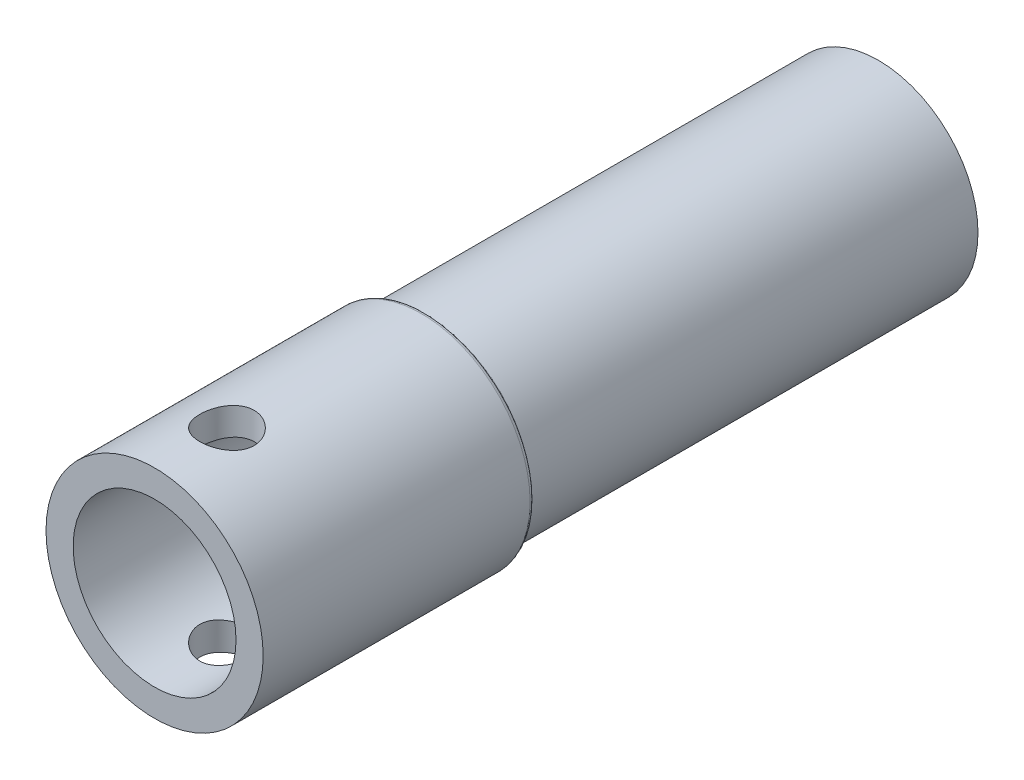
ISO-10303-21;
HEADER;
FILE_DESCRIPTION(('STEP AP214'),'2;1');
FILE_NAME('part.step','',(''),(''),'','','');
FILE_SCHEMA(('AUTOMOTIVE_DESIGN { 1 0 10303 214 1 1 1 1 }'));
ENDSEC;
DATA;
#1=APPLICATION_CONTEXT('core data for automotive mechanical design processes');
#2=APPLICATION_PROTOCOL_DEFINITION('international standard','automotive_design',2000,#1);
#3=PRODUCT_CONTEXT('',#1,'mechanical');
#4=PRODUCT('Part','Part','',(#3));
#5=PRODUCT_RELATED_PRODUCT_CATEGORY('part','',(#4));
#6=PRODUCT_DEFINITION_FORMATION('','',#4);
#7=PRODUCT_DEFINITION_CONTEXT('part definition',#1,'design');
#8=PRODUCT_DEFINITION('design','',#6,#7);
#9=PRODUCT_DEFINITION_SHAPE('','',#8);
#10=(LENGTH_UNIT() NAMED_UNIT(*) SI_UNIT(.MILLI.,.METRE.));
#11=(NAMED_UNIT(*) PLANE_ANGLE_UNIT() SI_UNIT($,.RADIAN.));
#12=(NAMED_UNIT(*) SI_UNIT($,.STERADIAN.) SOLID_ANGLE_UNIT());
#13=UNCERTAINTY_MEASURE_WITH_UNIT(LENGTH_MEASURE(1.E-05),#10,'distance_accuracy_value','');
#14=(GEOMETRIC_REPRESENTATION_CONTEXT(3) GLOBAL_UNCERTAINTY_ASSIGNED_CONTEXT((#13)) GLOBAL_UNIT_ASSIGNED_CONTEXT((#10,
#11,#12)) REPRESENTATION_CONTEXT('',''));
#15=CARTESIAN_POINT('',(0.,0.,0.));
#16=DIRECTION('',(0.,0.,1.));
#17=DIRECTION('',(1.,0.,0.));
#18=AXIS2_PLACEMENT_3D('',#15,#16,#17);
#19=CARTESIAN_POINT('',(0.,0.,30.));
#20=DIRECTION('',(0.,0.,1.));
#21=DIRECTION('',(1.,0.,0.));
#22=AXIS2_PLACEMENT_3D('',#19,#20,#21);
#23=PLANE('',#22);
#24=CARTESIAN_POINT('',(0.,0.,30.));
#25=DIRECTION('',(0.,0.,1.));
#26=DIRECTION('',(1.,0.,0.));
#27=AXIS2_PLACEMENT_3D('',#24,#25,#26);
#28=CIRCLE('',#27,12.);
#29=CARTESIAN_POINT('',(12.,0.,30.));
#30=VERTEX_POINT('',#29);
#31=EDGE_CURVE('E53',#30,#30,#28,.T.);
#32=ORIENTED_EDGE('',*,*,#31,.T.);
#33=EDGE_LOOP('',(#32));
#34=FACE_BOUND('',#33,.T.);
#35=CARTESIAN_POINT('',(0.,0.,30.));
#36=DIRECTION('',(0.,0.,1.));
#37=DIRECTION('',(1.,0.,0.));
#38=AXIS2_PLACEMENT_3D('',#35,#36,#37);
#39=CIRCLE('',#38,9.);
#40=CARTESIAN_POINT('',(9.,0.,30.));
#41=VERTEX_POINT('',#40);
#42=EDGE_CURVE('E122',#41,#41,#39,.T.);
#43=ORIENTED_EDGE('',*,*,#42,.F.);
#44=EDGE_LOOP('',(#43));
#45=FACE_BOUND('',#44,.T.);
#46=ADVANCED_FACE('F39',(#34,#45),#23,.T.);
#47=CARTESIAN_POINT('',(0.,0.,30.));
#48=DIRECTION('',(0.,0.,-1.));
#49=DIRECTION('',(-1.,0.,0.));
#50=AXIS2_PLACEMENT_3D('',#47,#48,#49);
#51=CYLINDRICAL_SURFACE('',#50,12.);
#52=CARTESIAN_POINT('',(0.,0.,0.5));
#53=DIRECTION('',(0.,0.,1.));
#54=DIRECTION('',(1.,0.,0.));
#55=AXIS2_PLACEMENT_3D('',#52,#53,#54);
#56=CIRCLE('',#55,12.);
#57=CARTESIAN_POINT('',(12.,0.,0.5));
#58=VERTEX_POINT('',#57);
#59=EDGE_CURVE('E48',#58,#58,#56,.T.);
#60=ORIENTED_EDGE('',*,*,#59,.T.);
#61=EDGE_LOOP('',(#60));
#62=FACE_BOUND('',#61,.T.);
#63=CARTESIAN_POINT('',(0.,-12.,25.));
#64=CARTESIAN_POINT('',(0.165752177339462,-11.9999971973602,24.9999953485237));
#65=CARTESIAN_POINT('',(0.331556315661526,-11.9965315626365,24.9862168984524));
#66=CARTESIAN_POINT('',(0.658412647541065,-11.9830422765979,24.931549697386));
#67=CARTESIAN_POINT('',(0.819462093741479,-11.9730149083995,24.8906455809243));
#68=CARTESIAN_POINT('',(1.13204174436515,-11.9475125266406,24.7831214930758));
#69=CARTESIAN_POINT('',(1.28358312686,-11.9320440568412,24.7165324025695));
#70=CARTESIAN_POINT('',(1.57334426380885,-11.8973068761524,24.5596372199103));
#71=CARTESIAN_POINT('',(1.71156356869753,-11.8780380370831,24.4693303277621));
#72=CARTESIAN_POINT('',(1.97360385460183,-11.8373482718339,24.2655984206916));
#73=CARTESIAN_POINT('',(2.09711138012211,-11.8158941429625,24.1517768500819));
#74=CARTESIAN_POINT('',(2.32349785440664,-11.7734724023587,23.9050955901819));
#75=CARTESIAN_POINT('',(2.42637447389838,-11.7525048457974,23.7722337541061));
#76=CARTESIAN_POINT('',(2.61005308559795,-11.7130955139634,23.488809546526));
#77=CARTESIAN_POINT('',(2.69050443185028,-11.6946958892962,23.3380135383825));
#78=CARTESIAN_POINT('',(2.82479381710149,-11.6629898963603,23.0245031766799));
#79=CARTESIAN_POINT('',(2.87863611088028,-11.6496827138884,22.861790733336));
#80=CARTESIAN_POINT('',(2.95710967360953,-11.6300095339265,22.5325130035967));
#81=CARTESIAN_POINT('',(2.98230453666411,-11.6235098199402,22.366090207924));
#82=CARTESIAN_POINT('',(3.00452355013282,-11.6177872491918,22.0312628620013));
#83=CARTESIAN_POINT('',(3.00155228363622,-11.6185632085586,21.8628586386157));
#84=CARTESIAN_POINT('',(2.96797304927941,-11.6271841103363,21.5331683845093));
#85=CARTESIAN_POINT('',(2.93803668038127,-11.6348572601459,21.3718087570693));
#86=CARTESIAN_POINT('',(2.85244837380599,-11.6561341934214,21.0564778981779));
#87=CARTESIAN_POINT('',(2.79679460413879,-11.6697383993848,20.9025071939422));
#88=CARTESIAN_POINT('',(2.66077895587437,-11.7015022781132,20.6045239674957));
#89=CARTESIAN_POINT('',(2.58017333446584,-11.7197065493963,20.4606276564209));
#90=CARTESIAN_POINT('',(2.39671255202989,-11.7585942169198,20.1881625804864));
#91=CARTESIAN_POINT('',(2.29385349761767,-11.7792780466926,20.0595965038655));
#92=CARTESIAN_POINT('',(2.06532684936244,-11.8215176107978,19.8175927686112));
#93=CARTESIAN_POINT('',(1.93909251633172,-11.84308138956,19.7046910198773));
#94=CARTESIAN_POINT('',(1.6692238350074,-11.8841193115751,19.5015575150722));
#95=CARTESIAN_POINT('',(1.52558895541589,-11.9035933909882,19.4113264514729));
#96=CARTESIAN_POINT('',(1.22423177736278,-11.9383546418838,19.2558988275512));
#97=CARTESIAN_POINT('',(1.06646278641725,-11.9536272025545,19.1907893194911));
#98=CARTESIAN_POINT('',(0.741752016285768,-11.9781583398283,19.0881653885809));
#99=CARTESIAN_POINT('',(0.574811998300971,-11.9874180667856,19.0506456871637));
#100=CARTESIAN_POINT('',(0.241079940780054,-11.9987099854275,19.0050848688823));
#101=CARTESIAN_POINT('',(0.0743934399764207,-12.0009210701655,18.9963139478494));
#102=CARTESIAN_POINT('',(-0.258065749603016,-11.998376096289,19.006498004111));
#103=CARTESIAN_POINT('',(-0.423838519289191,-11.9936206648371,19.0254504855983));
#104=CARTESIAN_POINT('',(-0.747228537552979,-11.977791622547,19.0899418167827));
#105=CARTESIAN_POINT('',(-0.904930237937498,-11.9668126837158,19.1350825269539));
#106=CARTESIAN_POINT('',(-1.21051458490503,-11.9397741326831,19.2502141680569));
#107=CARTESIAN_POINT('',(-1.3583962380653,-11.9237140073996,19.3202076086264));
#108=CARTESIAN_POINT('',(-1.64304626885966,-11.8878661585244,19.4844722577493));
#109=CARTESIAN_POINT('',(-1.77957088367153,-11.868017347332,19.5791522247931));
#110=CARTESIAN_POINT('',(-2.03505322728662,-11.826890183755,19.7895798175943));
#111=CARTESIAN_POINT('',(-2.15400791794649,-11.8056115850589,19.9053310792353));
#112=CARTESIAN_POINT('',(-2.37398113614497,-11.76337913919,20.1580039216874));
#113=CARTESIAN_POINT('',(-2.4744877352422,-11.7424460836496,20.2953754059991));
#114=CARTESIAN_POINT('',(-2.65102151802725,-11.7038575676408,20.5854652689372));
#115=CARTESIAN_POINT('',(-2.72704978832281,-11.6862019616993,20.7381829659409));
#116=CARTESIAN_POINT('',(-2.85190284121468,-11.656361894336,21.0538114448125));
#117=CARTESIAN_POINT('',(-2.90088879328717,-11.6441451045097,21.2166552566246));
#118=CARTESIAN_POINT('',(-2.97069131988587,-11.626534880479,21.5486192757106));
#119=CARTESIAN_POINT('',(-2.99151405495182,-11.6211399540485,21.7177381020429));
#120=CARTESIAN_POINT('',(-3.004077180673,-11.6178980244194,22.0522420477232));
#121=CARTESIAN_POINT('',(-2.99663579556158,-11.6198386546564,22.2175948702529));
#122=CARTESIAN_POINT('',(-2.95475455662439,-11.6305581800657,22.5446077773325));
#123=CARTESIAN_POINT('',(-2.92031524537318,-11.6393369378128,22.7062679360264));
#124=CARTESIAN_POINT('',(-2.82586263888595,-11.6626252136787,23.0204169181317));
#125=CARTESIAN_POINT('',(-2.76600280936085,-11.6771003047327,23.1729546104807));
#126=CARTESIAN_POINT('',(-2.62252982721005,-11.7101551144901,23.4659307654271));
#127=CARTESIAN_POINT('',(-2.53891338006835,-11.7287354024137,23.6063675463738));
#128=CARTESIAN_POINT('',(-2.3477354972743,-11.7685126852721,23.8751092580041));
#129=CARTESIAN_POINT('',(-2.23960632582452,-11.7897652966356,24.0030021468479));
#130=CARTESIAN_POINT('',(-2.00357874237946,-11.8321605449252,24.2390940895908));
#131=CARTESIAN_POINT('',(-1.87567564252229,-11.8533031545411,24.3472884602259));
#132=CARTESIAN_POINT('',(-1.60093517340518,-11.8935531129534,24.5428226171292));
#133=CARTESIAN_POINT('',(-1.45379684463277,-11.9126166673174,24.6297492273432));
#134=CARTESIAN_POINT('',(-1.14653211902095,-11.9460984995023,24.7774949258811));
#135=CARTESIAN_POINT('',(-0.986415126873481,-11.9605201039956,24.8383327212971));
#136=CARTESIAN_POINT('',(-0.688820506486946,-11.9809611913108,24.9231436606593));
#137=CARTESIAN_POINT('',(-0.55276034181614,-11.9880517010538,24.9519024861069));
#138=CARTESIAN_POINT('',(-0.277812143072569,-11.997572104639,24.9903318872439));
#139=CARTESIAN_POINT('',(-0.138924322485234,-12.0000023490179,25.0000038986106));
#140=CARTESIAN_POINT('',(0.,-12.,25.));
#141=B_SPLINE_CURVE_WITH_KNOTS('',3,(#63,#64,#65,#66,#67,#68,#69,#70,#71,#72,#73,#74,#75,#76,
#77,#78,#79,#80,#81,#82,#83,#84,#85,#86,#87,#88,#89,#90,#91,#92,#93,#94,#95,#96,#97,#98,#99,
#100,#101,#102,#103,#104,#105,#106,#107,#108,#109,#110,#111,#112,#113,#114,#115,#116,#117,#118,
#119,#120,#121,#122,#123,#124,#125,#126,#127,#128,#129,#130,#131,#132,#133,#134,#135,#136,#137,
#138,#139,#140),.UNSPECIFIED.,.T.,.F.,(4,2,2,2,2,2,2,2,2,2,2,2,2,2,2,2,2,2,2,2,2,2,2,2,2,2,2,2,
2,2,2,2,2,2,2,2,2,2,4),(0.,0.496747424943779,0.993776475527798,1.49020980457221,
1.98665988033865,2.49228870874278,2.99797459160124,3.51117295091614,4.02428922338737,
4.52712590202139,5.02988076232035,5.52044994020677,6.01105406938718,6.506610557544,
7.00225381678967,7.5120300194468,8.02182179123135,8.53336458024869,9.04480947383927,
9.54316617905194,10.0414780223213,10.5324054903472,11.0233825465122,11.5230717513735,
12.0228472602268,12.5348901841559,13.0469103750566,13.5558450923716,14.0646684651657,
14.5588756080898,15.0530728192382,15.5443280113065,16.0356513628556,16.5397915283158,
17.0440513955259,17.5574437101093,18.0704672765446,18.4868448589605,18.9031911209784),.UNSPECIFIED.);
#142=CARTESIAN_POINT('',(0.,-12.,25.));
#143=VERTEX_POINT('',#142);
#144=EDGE_CURVE('E94',#143,#143,#141,.T.);
#145=ORIENTED_EDGE('',*,*,#144,.T.);
#146=EDGE_LOOP('',(#145));
#147=FACE_BOUND('',#146,.T.);
#148=CARTESIAN_POINT('',(0.,12.,25.));
#149=CARTESIAN_POINT('',(-0.165752177339462,11.9999971973602,24.9999953485237));
#150=CARTESIAN_POINT('',(-0.331556315661527,11.9965315626365,24.9862168984524));
#151=CARTESIAN_POINT('',(-0.658412647541066,11.9830422765979,24.931549697386));
#152=CARTESIAN_POINT('',(-0.819462093741479,11.9730149083995,24.8906455809243));
#153=CARTESIAN_POINT('',(-1.13204174436515,11.9475125266406,24.7831214930758));
#154=CARTESIAN_POINT('',(-1.28358312686,11.9320440568412,24.7165324025695));
#155=CARTESIAN_POINT('',(-1.57334426380885,11.8973068761524,24.5596372199103));
#156=CARTESIAN_POINT('',(-1.71156356869753,11.8780380370831,24.4693303277621));
#157=CARTESIAN_POINT('',(-1.97360385460183,11.8373482718339,24.2655984206916));
#158=CARTESIAN_POINT('',(-2.09711138012211,11.8158941429625,24.1517768500819));
#159=CARTESIAN_POINT('',(-2.32349785440664,11.7734724023587,23.9050955901819));
#160=CARTESIAN_POINT('',(-2.42637447389838,11.7525048457974,23.7722337541061));
#161=CARTESIAN_POINT('',(-2.61005308559795,11.7130955139634,23.488809546526));
#162=CARTESIAN_POINT('',(-2.69050443185028,11.6946958892962,23.3380135383825));
#163=CARTESIAN_POINT('',(-2.82479381710149,11.6629898963603,23.0245031766799));
#164=CARTESIAN_POINT('',(-2.87863611088028,11.6496827138884,22.861790733336));
#165=CARTESIAN_POINT('',(-2.95710967360953,11.6300095339265,22.5325130035967));
#166=CARTESIAN_POINT('',(-2.98230453666411,11.6235098199402,22.366090207924));
#167=CARTESIAN_POINT('',(-3.00452355013282,11.6177872491918,22.0312628620013));
#168=CARTESIAN_POINT('',(-3.00155228363622,11.6185632085586,21.8628586386157));
#169=CARTESIAN_POINT('',(-2.96797304927941,11.6271841103363,21.5331683845093));
#170=CARTESIAN_POINT('',(-2.93803668038127,11.6348572601459,21.3718087570693));
#171=CARTESIAN_POINT('',(-2.85244837380599,11.6561341934214,21.0564778981779));
#172=CARTESIAN_POINT('',(-2.79679460413879,11.6697383993848,20.9025071939422));
#173=CARTESIAN_POINT('',(-2.66077895587437,11.7015022781132,20.6045239674957));
#174=CARTESIAN_POINT('',(-2.58017333446584,11.7197065493963,20.4606276564209));
#175=CARTESIAN_POINT('',(-2.39671255202989,11.7585942169198,20.1881625804864));
#176=CARTESIAN_POINT('',(-2.29385349761767,11.7792780466926,20.0595965038655));
#177=CARTESIAN_POINT('',(-2.06532684936244,11.8215176107978,19.8175927686112));
#178=CARTESIAN_POINT('',(-1.93909251633172,11.84308138956,19.7046910198773));
#179=CARTESIAN_POINT('',(-1.6692238350074,11.8841193115751,19.5015575150722));
#180=CARTESIAN_POINT('',(-1.52558895541589,11.9035933909881,19.4113264514729));
#181=CARTESIAN_POINT('',(-1.22423177736279,11.9383546418838,19.2558988275512));
#182=CARTESIAN_POINT('',(-1.06646278641725,11.9536272025545,19.1907893194911));
#183=CARTESIAN_POINT('',(-0.741752016285768,11.9781583398283,19.0881653885809));
#184=CARTESIAN_POINT('',(-0.574811998300971,11.9874180667856,19.0506456871637));
#185=CARTESIAN_POINT('',(-0.241079940780054,11.9987099854275,19.0050848688823));
#186=CARTESIAN_POINT('',(-0.0743934399764209,12.0009210701655,18.9963139478494));
#187=CARTESIAN_POINT('',(0.258065749603016,11.998376096289,19.006498004111));
#188=CARTESIAN_POINT('',(0.423838519289192,11.9936206648371,19.0254504855983));
#189=CARTESIAN_POINT('',(0.747228537552981,11.977791622547,19.0899418167827));
#190=CARTESIAN_POINT('',(0.904930237937499,11.9668126837158,19.1350825269539));
#191=CARTESIAN_POINT('',(1.21051458490503,11.9397741326831,19.2502141680569));
#192=CARTESIAN_POINT('',(1.3583962380653,11.9237140073996,19.3202076086264));
#193=CARTESIAN_POINT('',(1.64304626885966,11.8878661585244,19.4844722577493));
#194=CARTESIAN_POINT('',(1.77957088367153,11.868017347332,19.5791522247931));
#195=CARTESIAN_POINT('',(2.03505322728662,11.826890183755,19.7895798175943));
#196=CARTESIAN_POINT('',(2.1540079179465,11.8056115850589,19.9053310792353));
#197=CARTESIAN_POINT('',(2.37398113614497,11.76337913919,20.1580039216874));
#198=CARTESIAN_POINT('',(2.47448773524221,11.7424460836496,20.2953754059991));
#199=CARTESIAN_POINT('',(2.65102151802725,11.7038575676408,20.5854652689372));
#200=CARTESIAN_POINT('',(2.72704978832281,11.6862019616993,20.7381829659409));
#201=CARTESIAN_POINT('',(2.85190284121468,11.656361894336,21.0538114448125));
#202=CARTESIAN_POINT('',(2.90088879328717,11.6441451045097,21.2166552566246));
#203=CARTESIAN_POINT('',(2.97069131988587,11.626534880479,21.5486192757106));
#204=CARTESIAN_POINT('',(2.99151405495183,11.6211399540485,21.7177381020429));
#205=CARTESIAN_POINT('',(3.004077180673,11.6178980244194,22.0522420477232));
#206=CARTESIAN_POINT('',(2.99663579556158,11.6198386546564,22.2175948702529));
#207=CARTESIAN_POINT('',(2.95475455662439,11.6305581800657,22.5446077773325));
#208=CARTESIAN_POINT('',(2.92031524537318,11.6393369378128,22.7062679360264));
#209=CARTESIAN_POINT('',(2.82586263888594,11.6626252136787,23.0204169181317));
#210=CARTESIAN_POINT('',(2.76600280936085,11.6771003047327,23.1729546104807));
#211=CARTESIAN_POINT('',(2.62252982721005,11.7101551144901,23.4659307654271));
#212=CARTESIAN_POINT('',(2.53891338006835,11.7287354024137,23.6063675463738));
#213=CARTESIAN_POINT('',(2.3477354972743,11.7685126852721,23.8751092580041));
#214=CARTESIAN_POINT('',(2.23960632582452,11.7897652966356,24.0030021468479));
#215=CARTESIAN_POINT('',(2.00357874237946,11.8321605449252,24.2390940895908));
#216=CARTESIAN_POINT('',(1.87567564252229,11.8533031545411,24.3472884602259));
#217=CARTESIAN_POINT('',(1.60093517340518,11.8935531129534,24.5428226171292));
#218=CARTESIAN_POINT('',(1.45379684463277,11.9126166673174,24.6297492273432));
#219=CARTESIAN_POINT('',(1.14653211902095,11.9460984995023,24.7774949258811));
#220=CARTESIAN_POINT('',(0.98641512687348,11.9605201039956,24.8383327212971));
#221=CARTESIAN_POINT('',(0.688820506486945,11.9809611913108,24.9231436606593));
#222=CARTESIAN_POINT('',(0.552760341816138,11.9880517010538,24.9519024861069));
#223=CARTESIAN_POINT('',(0.277812143072567,11.997572104639,24.9903318872439));
#224=CARTESIAN_POINT('',(0.138924322485233,12.0000023490179,25.0000038986106));
#225=CARTESIAN_POINT('',(0.,12.,25.));
#226=B_SPLINE_CURVE_WITH_KNOTS('',3,(#148,#149,#150,#151,#152,#153,#154,#155,#156,#157,#158,
#159,#160,#161,#162,#163,#164,#165,#166,#167,#168,#169,#170,#171,#172,#173,#174,#175,#176,#177,
#178,#179,#180,#181,#182,#183,#184,#185,#186,#187,#188,#189,#190,#191,#192,#193,#194,#195,#196,
#197,#198,#199,#200,#201,#202,#203,#204,#205,#206,#207,#208,#209,#210,#211,#212,#213,#214,#215,
#216,#217,#218,#219,#220,#221,#222,#223,#224,#225),.UNSPECIFIED.,.T.,.F.,(4,2,2,2,2,2,2,2,2,2,2,
2,2,2,2,2,2,2,2,2,2,2,2,2,2,2,2,2,2,2,2,2,2,2,2,2,2,2,4),(0.,0.49674742494378,0.993776475527799,
1.49020980457221,1.98665988033865,2.49228870874278,2.99797459160124,3.51117295091614,
4.02428922338737,4.5271259020214,5.02988076232035,5.52044994020677,6.01105406938718,
6.506610557544,7.00225381678967,7.5120300194468,8.02182179123135,8.53336458024869,
9.04480947383927,9.54316617905193,10.0414780223213,10.5324054903472,11.0233825465122,
11.5230717513734,12.0228472602268,12.5348901841559,13.0469103750566,13.5558450923716,
14.0646684651657,14.5588756080898,15.0530728192382,15.5443280113065,16.0356513628556,
16.5397915283158,17.0440513955259,17.5574437101093,18.0704672765446,18.4868448589605,
18.9031911209784),.UNSPECIFIED.);
#227=CARTESIAN_POINT('',(0.,12.,25.));
#228=VERTEX_POINT('',#227);
#229=EDGE_CURVE('E65',#228,#228,#226,.T.);
#230=ORIENTED_EDGE('',*,*,#229,.T.);
#231=EDGE_LOOP('',(#230));
#232=FACE_BOUND('',#231,.T.);
#233=ORIENTED_EDGE('',*,*,#31,.F.);
#234=EDGE_LOOP('',(#233));
#235=FACE_BOUND('',#234,.T.);
#236=ADVANCED_FACE('F99',(#62,#147,#232,#235),#51,.T.);
#237=CARTESIAN_POINT('',(0.,0.,30.));
#238=DIRECTION('',(0.,0.,-1.));
#239=DIRECTION('',(-1.,0.,0.));
#240=AXIS2_PLACEMENT_3D('',#237,#238,#239);
#241=CYLINDRICAL_SURFACE('',#240,9.);
#242=CARTESIAN_POINT('',(0.,-9.,25.));
#243=CARTESIAN_POINT('',(0.16369008866017,-9.00000045902832,25.0000007611949));
#244=CARTESIAN_POINT('',(0.327375583615649,-8.99549308522634,24.9865592016183));
#245=CARTESIAN_POINT('',(0.649925282618916,-8.97795630609842,24.9333126735483));
#246=CARTESIAN_POINT('',(0.808788984356453,-8.96492601606458,24.8935049681532));
#247=CARTESIAN_POINT('',(1.11699836850533,-8.93175923719328,24.7890422698479));
#248=CARTESIAN_POINT('',(1.2663594776581,-8.9116346319256,24.7244288126222));
#249=CARTESIAN_POINT('',(1.55212481041597,-8.86633337152025,24.572376481485));
#250=CARTESIAN_POINT('',(1.68852647087612,-8.84115572003334,24.4849331049922));
#251=CARTESIAN_POINT('',(1.9492250250668,-8.78742283329015,24.2865225854237));
#252=CARTESIAN_POINT('',(2.07301110089493,-8.75878669391354,24.1749062972185));
#253=CARTESIAN_POINT('',(2.30049807810625,-8.70180944349364,23.9326985358803));
#254=CARTESIAN_POINT('',(2.40419455646839,-8.67346839871647,23.8021028952145));
#255=CARTESIAN_POINT('',(2.59147482668358,-8.61939997431821,23.5210446544106));
#256=CARTESIAN_POINT('',(2.6743945746631,-8.59377117827064,23.3701187808036));
#257=CARTESIAN_POINT('',(2.81345662163316,-8.54925916255804,23.0554717166244));
#258=CARTESIAN_POINT('',(2.86960709216029,-8.53037388482237,22.8917544485118));
#259=CARTESIAN_POINT('',(2.95162038452749,-8.50233909808132,22.5619803355099));
#260=CARTESIAN_POINT('',(2.97844034481531,-8.49288287308834,22.3961883745328));
#261=CARTESIAN_POINT('',(3.00402337000343,-8.48386969888523,22.0622087375324));
#262=CARTESIAN_POINT('',(3.00279510481416,-8.4843096906819,21.8940218178724));
#263=CARTESIAN_POINT('',(2.97305971111026,-8.4947704502454,21.5681901086679));
#264=CARTESIAN_POINT('',(2.94580173950098,-8.50435247602599,21.4104147912429));
#265=CARTESIAN_POINT('',(2.86681848854825,-8.53129973173652,21.1018197411795));
#266=CARTESIAN_POINT('',(2.81509027977561,-8.54866589352322,20.9510008436948));
#267=CARTESIAN_POINT('',(2.68781717418063,-8.58953733393746,20.6577617512256));
#268=CARTESIAN_POINT('',(2.61190214612179,-8.61313697379352,20.5155159235914));
#269=CARTESIAN_POINT('',(2.43866731890942,-8.66377675727179,20.2453872751608));
#270=CARTESIAN_POINT('',(2.34134133709202,-8.69081789371391,20.1175086191999));
#271=CARTESIAN_POINT('',(2.12204799804671,-8.74701987503223,19.8727252055177));
#272=CARTESIAN_POINT('',(1.99905945022893,-8.77621768064528,19.7567419164728));
#273=CARTESIAN_POINT('',(1.73501870991019,-8.8322081516111,19.5468062000098));
#274=CARTESIAN_POINT('',(1.59396478698244,-8.85900058614202,19.4528558855065));
#275=CARTESIAN_POINT('',(1.2958428391388,-8.90751323813381,19.2889110992948));
#276=CARTESIAN_POINT('',(1.13862982924901,-8.92918050024118,19.2191635259778));
#277=CARTESIAN_POINT('',(0.813807250093523,-8.96461701433304,19.1073904781329));
#278=CARTESIAN_POINT('',(0.646201314464862,-8.97838900964638,19.0653553737297));
#279=CARTESIAN_POINT('',(0.313151488587913,-8.99602881214321,19.0118330019329));
#280=CARTESIAN_POINT('',(0.147928799594539,-9.00030005501184,18.9991005724817));
#281=CARTESIAN_POINT('',(-0.182325209880712,-8.99966708084482,19.0009980207954));
#282=CARTESIAN_POINT('',(-0.34735655795895,-8.99476441258087,19.0156232799396));
#283=CARTESIAN_POINT('',(-0.667559598912766,-8.97660074151313,19.0708357232079));
#284=CARTESIAN_POINT('',(-0.822878420504529,-8.96358596133577,19.1106586181485));
#285=CARTESIAN_POINT('',(-1.12456787573872,-8.9307554049021,19.2141803334002));
#286=CARTESIAN_POINT('',(-1.27093736552582,-8.91093876140025,19.2778821984034));
#287=CARTESIAN_POINT('',(-1.55486488917982,-8.86586793861869,19.4292112955224));
#288=CARTESIAN_POINT('',(-1.69208987765144,-8.84048444267358,19.5174237798495));
#289=CARTESIAN_POINT('',(-1.95019449040676,-8.78715761748787,19.7145824500404));
#290=CARTESIAN_POINT('',(-2.07106910338673,-8.75921350781483,19.8235349680953));
#291=CARTESIAN_POINT('',(-2.2987575234189,-8.70230543941334,20.0649362530198));
#292=CARTESIAN_POINT('',(-2.40468290773731,-8.67335283262284,20.1982276807806));
#293=CARTESIAN_POINT('',(-2.59277256697072,-8.61899919884126,20.4813147034327));
#294=CARTESIAN_POINT('',(-2.67493664379304,-8.59359820146007,20.6311104359022));
#295=CARTESIAN_POINT('',(-2.81279079124908,-8.54947175374151,20.9430190458697));
#296=CARTESIAN_POINT('',(-2.86853439649506,-8.53073282378936,21.1051062375063));
#297=CARTESIAN_POINT('',(-2.95168400027807,-8.50232496919349,21.4371359501324));
#298=CARTESIAN_POINT('',(-2.97910276486182,-8.49265195870918,21.607074896213));
#299=CARTESIAN_POINT('',(-3.00382884743203,-8.48393576622531,21.9405912881227));
#300=CARTESIAN_POINT('',(-3.0026107719252,-8.48437200772245,22.1040470208605));
#301=CARTESIAN_POINT('',(-2.97372688034608,-8.49453809471602,22.4282952247662));
#302=CARTESIAN_POINT('',(-2.94606263837576,-8.50426738708085,22.5890878538653));
#303=CARTESIAN_POINT('',(-2.86611543938804,-8.53153572914675,22.9004069890074));
#304=CARTESIAN_POINT('',(-2.81431003804654,-8.54892294067433,23.0510704750135));
#305=CARTESIAN_POINT('',(-2.68793809727924,-8.58949196455405,23.3416822208148));
#306=CARTESIAN_POINT('',(-2.61336650566142,-8.61267506290179,23.481628093564));
#307=CARTESIAN_POINT('',(-2.43978207775029,-8.66348487678139,23.7534510097687));
#308=CARTESIAN_POINT('',(-2.33984472829374,-8.69126134926411,23.8847095056952));
#309=CARTESIAN_POINT('',(-2.11992864940694,-8.74750068849758,24.1290694401526));
#310=CARTESIAN_POINT('',(-1.99994425335444,-8.77596374737117,24.2421657270642));
#311=CARTESIAN_POINT('',(-1.73772467076206,-8.83170091576632,24.4514332368675));
#312=CARTESIAN_POINT('',(-1.59480454049919,-8.8588854540377,24.546773043253));
#313=CARTESIAN_POINT('',(-1.29407207221987,-8.90777973517836,24.7119712865519));
#314=CARTESIAN_POINT('',(-1.13626355439705,-8.92949087723789,24.7818362377661));
#315=CARTESIAN_POINT('',(-0.817480941602929,-8.96416545205625,24.891164897466));
#316=CARTESIAN_POINT('',(-0.656963273029227,-8.97747637267568,24.9318473987901));
#317=CARTESIAN_POINT('',(-0.330961248030742,-8.99539221192665,24.9862608420314));
#318=CARTESIAN_POINT('',(-0.165478276706239,-8.99999953595715,24.9999992304896));
#319=CARTESIAN_POINT('',(0.,-9.,25.));
#320=B_SPLINE_CURVE_WITH_KNOTS('',3,(#242,#243,#244,#245,#246,#247,#248,#249,#250,#251,#252,
#253,#254,#255,#256,#257,#258,#259,#260,#261,#262,#263,#264,#265,#266,#267,#268,#269,#270,#271,
#272,#273,#274,#275,#276,#277,#278,#279,#280,#281,#282,#283,#284,#285,#286,#287,#288,#289,#290,
#291,#292,#293,#294,#295,#296,#297,#298,#299,#300,#301,#302,#303,#304,#305,#306,#307,#308,#309,
#310,#311,#312,#313,#314,#315,#316,#317,#318,#319),.UNSPECIFIED.,.T.,.F.,(4,2,2,2,2,2,2,2,2,2,2,
2,2,2,2,2,2,2,2,2,2,2,2,2,2,2,2,2,2,2,2,2,2,2,2,2,2,2,4),(0.,0.490461318078033,
0.980973555802561,1.47066801861082,1.9604591333973,2.46554052848268,2.97073299862591,
3.49045154470411,4.010011340785,4.5120577722552,5.01394901962456,5.4929047965384,
5.97191792566446,6.45864513465392,6.94551307674621,7.45779917434101,7.97013437899855,
8.48755216951073,9.00479006631625,9.49960749525509,9.9943413949253,10.4747447393464,
10.9552093585231,11.4483119953121,11.9415654246567,12.4572306864226,12.9729002470499,
13.4875204148031,14.0019085411752,14.4898699819277,14.9778023805413,15.4564676124125,
15.9352391452793,16.4349020007541,16.9347063337134,17.453989825053,17.9731404345737,
18.4690967512144,18.9649159811442),.UNSPECIFIED.);
#321=CARTESIAN_POINT('',(0.,-9.,25.));
#322=VERTEX_POINT('',#321);
#323=EDGE_CURVE('E56',#322,#322,#320,.T.);
#324=ORIENTED_EDGE('',*,*,#323,.F.);
#325=EDGE_LOOP('',(#324));
#326=FACE_BOUND('',#325,.T.);
#327=CARTESIAN_POINT('',(0.,9.,25.));
#328=CARTESIAN_POINT('',(-0.16369008866017,9.00000045902832,25.0000007611949));
#329=CARTESIAN_POINT('',(-0.32737558361565,8.99549308522634,24.9865592016183));
#330=CARTESIAN_POINT('',(-0.649925282618917,8.97795630609842,24.9333126735483));
#331=CARTESIAN_POINT('',(-0.808788984356454,8.96492601606458,24.8935049681532));
#332=CARTESIAN_POINT('',(-1.11699836850533,8.93175923719328,24.7890422698479));
#333=CARTESIAN_POINT('',(-1.2663594776581,8.9116346319256,24.7244288126222));
#334=CARTESIAN_POINT('',(-1.55212481041597,8.86633337152025,24.572376481485));
#335=CARTESIAN_POINT('',(-1.68852647087612,8.84115572003334,24.4849331049922));
#336=CARTESIAN_POINT('',(-1.9492250250668,8.78742283329015,24.2865225854237));
#337=CARTESIAN_POINT('',(-2.07301110089493,8.75878669391354,24.1749062972185));
#338=CARTESIAN_POINT('',(-2.30049807810625,8.70180944349364,23.9326985358803));
#339=CARTESIAN_POINT('',(-2.40419455646839,8.67346839871647,23.8021028952145));
#340=CARTESIAN_POINT('',(-2.59147482668358,8.61939997431821,23.5210446544106));
#341=CARTESIAN_POINT('',(-2.6743945746631,8.59377117827064,23.3701187808036));
#342=CARTESIAN_POINT('',(-2.81345662163316,8.54925916255803,23.0554717166244));
#343=CARTESIAN_POINT('',(-2.86960709216029,8.53037388482237,22.8917544485118));
#344=CARTESIAN_POINT('',(-2.95162038452749,8.50233909808132,22.5619803355099));
#345=CARTESIAN_POINT('',(-2.97844034481531,8.49288287308834,22.3961883745328));
#346=CARTESIAN_POINT('',(-3.00402337000343,8.48386969888523,22.0622087375324));
#347=CARTESIAN_POINT('',(-3.00279510481416,8.4843096906819,21.8940218178724));
#348=CARTESIAN_POINT('',(-2.97305971111026,8.4947704502454,21.5681901086679));
#349=CARTESIAN_POINT('',(-2.94580173950098,8.50435247602599,21.4104147912429));
#350=CARTESIAN_POINT('',(-2.86681848854825,8.53129973173653,21.1018197411795));
#351=CARTESIAN_POINT('',(-2.81509027977561,8.54866589352322,20.9510008436948));
#352=CARTESIAN_POINT('',(-2.68781717418063,8.58953733393746,20.6577617512256));
#353=CARTESIAN_POINT('',(-2.61190214612179,8.61313697379352,20.5155159235914));
#354=CARTESIAN_POINT('',(-2.43866731890942,8.66377675727179,20.2453872751608));
#355=CARTESIAN_POINT('',(-2.34134133709202,8.6908178937139,20.1175086191999));
#356=CARTESIAN_POINT('',(-2.12204799804671,8.74701987503222,19.8727252055177));
#357=CARTESIAN_POINT('',(-1.99905945022894,8.77621768064528,19.7567419164728));
#358=CARTESIAN_POINT('',(-1.73501870991019,8.8322081516111,19.5468062000098));
#359=CARTESIAN_POINT('',(-1.59396478698245,8.85900058614202,19.4528558855065));
#360=CARTESIAN_POINT('',(-1.29584283913881,8.90751323813381,19.2889110992948));
#361=CARTESIAN_POINT('',(-1.13862982924901,8.92918050024118,19.2191635259778));
#362=CARTESIAN_POINT('',(-0.813807250093523,8.96461701433304,19.1073904781329));
#363=CARTESIAN_POINT('',(-0.646201314464861,8.97838900964638,19.0653553737297));
#364=CARTESIAN_POINT('',(-0.313151488587912,8.99602881214321,19.0118330019329));
#365=CARTESIAN_POINT('',(-0.147928799594539,9.00030005501184,18.9991005724817));
#366=CARTESIAN_POINT('',(0.182325209880712,8.99966708084482,19.0009980207954));
#367=CARTESIAN_POINT('',(0.347356557958951,8.99476441258087,19.0156232799396));
#368=CARTESIAN_POINT('',(0.667559598912767,8.97660074151313,19.0708357232079));
#369=CARTESIAN_POINT('',(0.82287842050453,8.96358596133577,19.1106586181485));
#370=CARTESIAN_POINT('',(1.12456787573872,8.9307554049021,19.2141803334002));
#371=CARTESIAN_POINT('',(1.27093736552582,8.91093876140025,19.2778821984034));
#372=CARTESIAN_POINT('',(1.55486488917982,8.86586793861869,19.4292112955224));
#373=CARTESIAN_POINT('',(1.69208987765144,8.84048444267358,19.5174237798495));
#374=CARTESIAN_POINT('',(1.95019449040676,8.78715761748787,19.7145824500404));
#375=CARTESIAN_POINT('',(2.07106910338673,8.75921350781483,19.8235349680953));
#376=CARTESIAN_POINT('',(2.2987575234189,8.70230543941334,20.0649362530198));
#377=CARTESIAN_POINT('',(2.40468290773731,8.67335283262283,20.1982276807806));
#378=CARTESIAN_POINT('',(2.59277256697072,8.61899919884126,20.4813147034327));
#379=CARTESIAN_POINT('',(2.67493664379304,8.59359820146007,20.6311104359022));
#380=CARTESIAN_POINT('',(2.81279079124908,8.54947175374151,20.9430190458697));
#381=CARTESIAN_POINT('',(2.86853439649506,8.53073282378936,21.1051062375063));
#382=CARTESIAN_POINT('',(2.95168400027807,8.50232496919349,21.4371359501324));
#383=CARTESIAN_POINT('',(2.97910276486182,8.49265195870918,21.607074896213));
#384=CARTESIAN_POINT('',(3.00382884743203,8.48393576622531,21.9405912881227));
#385=CARTESIAN_POINT('',(3.0026107719252,8.48437200772245,22.1040470208605));
#386=CARTESIAN_POINT('',(2.97372688034608,8.49453809471602,22.4282952247662));
#387=CARTESIAN_POINT('',(2.94606263837576,8.50426738708085,22.5890878538653));
#388=CARTESIAN_POINT('',(2.86611543938804,8.53153572914675,22.9004069890074));
#389=CARTESIAN_POINT('',(2.81431003804654,8.54892294067433,23.0510704750135));
#390=CARTESIAN_POINT('',(2.68793809727924,8.58949196455405,23.3416822208148));
#391=CARTESIAN_POINT('',(2.61336650566142,8.61267506290179,23.481628093564));
#392=CARTESIAN_POINT('',(2.43978207775029,8.66348487678139,23.7534510097687));
#393=CARTESIAN_POINT('',(2.33984472829374,8.69126134926411,23.8847095056952));
#394=CARTESIAN_POINT('',(2.11992864940694,8.74750068849758,24.1290694401526));
#395=CARTESIAN_POINT('',(1.99994425335444,8.77596374737117,24.2421657270642));
#396=CARTESIAN_POINT('',(1.73772467076206,8.83170091576632,24.4514332368675));
#397=CARTESIAN_POINT('',(1.59480454049919,8.8588854540377,24.546773043253));
#398=CARTESIAN_POINT('',(1.29407207221987,8.90777973517836,24.7119712865519));
#399=CARTESIAN_POINT('',(1.13626355439705,8.92949087723789,24.7818362377661));
#400=CARTESIAN_POINT('',(0.817480941602929,8.96416545205625,24.891164897466));
#401=CARTESIAN_POINT('',(0.656963273029227,8.97747637267568,24.9318473987901));
#402=CARTESIAN_POINT('',(0.330961248030742,8.99539221192665,24.9862608420314));
#403=CARTESIAN_POINT('',(0.165478276706239,8.99999953595715,24.9999992304896));
#404=CARTESIAN_POINT('',(0.,9.,25.));
#405=B_SPLINE_CURVE_WITH_KNOTS('',3,(#327,#328,#329,#330,#331,#332,#333,#334,#335,#336,#337,
#338,#339,#340,#341,#342,#343,#344,#345,#346,#347,#348,#349,#350,#351,#352,#353,#354,#355,#356,
#357,#358,#359,#360,#361,#362,#363,#364,#365,#366,#367,#368,#369,#370,#371,#372,#373,#374,#375,
#376,#377,#378,#379,#380,#381,#382,#383,#384,#385,#386,#387,#388,#389,#390,#391,#392,#393,#394,
#395,#396,#397,#398,#399,#400,#401,#402,#403,#404),.UNSPECIFIED.,.T.,.F.,(4,2,2,2,2,2,2,2,2,2,2,
2,2,2,2,2,2,2,2,2,2,2,2,2,2,2,2,2,2,2,2,2,2,2,2,2,2,2,4),(0.,0.490461318078033,
0.980973555802562,1.47066801861082,1.9604591333973,2.46554052848268,2.97073299862591,
3.49045154470412,4.010011340785,4.5120577722552,5.01394901962456,5.4929047965384,
5.97191792566446,6.45864513465392,6.94551307674621,7.45779917434101,7.97013437899855,
8.48755216951073,9.00479006631625,9.49960749525509,9.9943413949253,10.4747447393464,
10.9552093585231,11.4483119953121,11.9415654246567,12.4572306864226,12.9729002470499,
13.4875204148031,14.0019085411752,14.4898699819277,14.9778023805413,15.4564676124125,
15.9352391452793,16.4349020007541,16.9347063337134,17.453989825053,17.9731404345737,
18.4690967512144,18.9649159811442),.UNSPECIFIED.);
#406=CARTESIAN_POINT('',(0.,9.,25.));
#407=VERTEX_POINT('',#406);
#408=EDGE_CURVE('E66',#407,#407,#405,.T.);
#409=ORIENTED_EDGE('',*,*,#408,.F.);
#410=EDGE_LOOP('',(#409));
#411=FACE_BOUND('',#410,.T.);
#412=ORIENTED_EDGE('',*,*,#42,.T.);
#413=EDGE_LOOP('',(#412));
#414=FACE_BOUND('',#413,.T.);
#415=CARTESIAN_POINT('',(0.,0.,0.));
#416=DIRECTION('',(0.,0.,1.));
#417=DIRECTION('',(1.,0.,0.));
#418=AXIS2_PLACEMENT_3D('',#415,#416,#417);
#419=CIRCLE('',#418,9.);
#420=CARTESIAN_POINT('',(9.,0.,0.));
#421=VERTEX_POINT('',#420);
#422=EDGE_CURVE('E125',#421,#421,#419,.T.);
#423=ORIENTED_EDGE('',*,*,#422,.F.);
#424=EDGE_LOOP('',(#423));
#425=FACE_BOUND('',#424,.T.);
#426=ADVANCED_FACE('F71',(#326,#411,#414,#425),#241,.F.);
#427=CARTESIAN_POINT('',(0.,0.,-50.));
#428=DIRECTION('',(0.,0.,-1.));
#429=DIRECTION('',(-1.,0.,0.));
#430=AXIS2_PLACEMENT_3D('',#427,#428,#429);
#431=PLANE('',#430);
#432=CARTESIAN_POINT('',(0.,0.,-50.));
#433=DIRECTION('',(0.,0.,-1.));
#434=DIRECTION('',(-1.,0.,0.));
#435=AXIS2_PLACEMENT_3D('',#432,#433,#434);
#436=CIRCLE('',#435,5.);
#437=CARTESIAN_POINT('',(-5.,0.,-50.));
#438=VERTEX_POINT('',#437);
#439=EDGE_CURVE('E137',#438,#438,#436,.T.);
#440=ORIENTED_EDGE('',*,*,#439,.F.);
#441=EDGE_LOOP('',(#440));
#442=FACE_BOUND('',#441,.T.);
#443=CARTESIAN_POINT('',(0.,0.,-50.));
#444=DIRECTION('',(0.,0.,-1.));
#445=DIRECTION('',(-1.,0.,0.));
#446=AXIS2_PLACEMENT_3D('',#443,#444,#445);
#447=CIRCLE('',#446,11.);
#448=CARTESIAN_POINT('',(-11.,0.,-50.));
#449=VERTEX_POINT('',#448);
#450=EDGE_CURVE('E130',#449,#449,#447,.T.);
#451=ORIENTED_EDGE('',*,*,#450,.T.);
#452=EDGE_LOOP('',(#451));
#453=FACE_BOUND('',#452,.T.);
#454=ADVANCED_FACE('F151',(#442,#453),#431,.T.);
#455=CARTESIAN_POINT('',(0.,0.,-50.));
#456=DIRECTION('',(0.,0.,1.));
#457=DIRECTION('',(1.,0.,0.));
#458=AXIS2_PLACEMENT_3D('',#455,#456,#457);
#459=CYLINDRICAL_SURFACE('',#458,11.);
#460=CARTESIAN_POINT('',(0.,0.,-0.5));
#461=DIRECTION('',(0.,0.,1.));
#462=DIRECTION('',(1.,0.,0.));
#463=AXIS2_PLACEMENT_3D('',#460,#461,#462);
#464=CIRCLE('',#463,11.);
#465=CARTESIAN_POINT('',(11.,0.,-0.5));
#466=VERTEX_POINT('',#465);
#467=EDGE_CURVE('E10',#466,#466,#464,.F.);
#468=ORIENTED_EDGE('',*,*,#467,.T.);
#469=EDGE_LOOP('',(#468));
#470=FACE_BOUND('',#469,.T.);
#471=ORIENTED_EDGE('',*,*,#450,.F.);
#472=EDGE_LOOP('',(#471));
#473=FACE_BOUND('',#472,.T.);
#474=ADVANCED_FACE('F154',(#470,#473),#459,.T.);
#475=CARTESIAN_POINT('',(0.,0.,0.));
#476=DIRECTION('',(0.,0.,-1.));
#477=DIRECTION('',(-1.,0.,0.));
#478=AXIS2_PLACEMENT_3D('',#475,#476,#477);
#479=PLANE('',#478);
#480=ORIENTED_EDGE('',*,*,#422,.T.);
#481=EDGE_LOOP('',(#480));
#482=FACE_BOUND('',#481,.T.);
#483=ADVANCED_FACE('F148',(#482),#479,.F.);
#484=CARTESIAN_POINT('',(0.,0.,-10.));
#485=DIRECTION('',(0.,0.,-1.));
#486=DIRECTION('',(-1.,0.,0.));
#487=AXIS2_PLACEMENT_3D('',#484,#485,#486);
#488=CYLINDRICAL_SURFACE('',#487,5.);
#489=CARTESIAN_POINT('',(0.,0.,-10.));
#490=DIRECTION('',(0.,0.,-1.));
#491=DIRECTION('',(-1.,0.,0.));
#492=AXIS2_PLACEMENT_3D('',#489,#490,#491);
#493=CIRCLE('',#492,5.);
#494=CARTESIAN_POINT('',(-5.,0.,-10.));
#495=VERTEX_POINT('',#494);
#496=EDGE_CURVE('E136',#495,#495,#493,.T.);
#497=ORIENTED_EDGE('',*,*,#496,.F.);
#498=EDGE_LOOP('',(#497));
#499=FACE_BOUND('',#498,.T.);
#500=ORIENTED_EDGE('',*,*,#439,.T.);
#501=EDGE_LOOP('',(#500));
#502=FACE_BOUND('',#501,.T.);
#503=ADVANCED_FACE('F145',(#499,#502),#488,.F.);
#504=CARTESIAN_POINT('',(0.,0.,-10.));
#505=DIRECTION('',(0.,0.,-1.));
#506=DIRECTION('',(-1.,0.,0.));
#507=AXIS2_PLACEMENT_3D('',#504,#505,#506);
#508=PLANE('',#507);
#509=ORIENTED_EDGE('',*,*,#496,.T.);
#510=EDGE_LOOP('',(#509));
#511=FACE_BOUND('',#510,.T.);
#512=ADVANCED_FACE('F81',(#511),#508,.T.);
#513=CARTESIAN_POINT('',(0.,-12.,22.));
#514=DIRECTION('',(0.,1.,0.));
#515=DIRECTION('',(0.,0.,1.));
#516=AXIS2_PLACEMENT_3D('',#513,#514,#515);
#517=CYLINDRICAL_SURFACE('',#516,3.);
#518=ORIENTED_EDGE('',*,*,#408,.T.);
#519=EDGE_LOOP('',(#518));
#520=FACE_BOUND('',#519,.T.);
#521=ORIENTED_EDGE('',*,*,#229,.F.);
#522=EDGE_LOOP('',(#521));
#523=FACE_BOUND('',#522,.T.);
#524=ADVANCED_FACE('F79',(#520,#523),#517,.F.);
#525=ORIENTED_EDGE('',*,*,#323,.T.);
#526=EDGE_LOOP('',(#525));
#527=FACE_BOUND('',#526,.T.);
#528=ORIENTED_EDGE('',*,*,#144,.F.);
#529=EDGE_LOOP('',(#528));
#530=FACE_BOUND('',#529,.T.);
#531=ADVANCED_FACE('F75',(#527,#530),#517,.F.);
#532=CARTESIAN_POINT('',(0.,0.,-0.5));
#533=DIRECTION('',(0.,0.,1.));
#534=DIRECTION('',(1.,0.,0.));
#535=AXIS2_PLACEMENT_3D('',#532,#533,#534);
#536=TOROIDAL_SURFACE('',#535,11.5,0.5);
#537=ORIENTED_EDGE('',*,*,#467,.F.);
#538=EDGE_LOOP('',(#537));
#539=FACE_BOUND('',#538,.T.);
#540=CARTESIAN_POINT('',(0.,0.,0.));
#541=DIRECTION('',(0.,0.,1.));
#542=DIRECTION('',(1.,0.,0.));
#543=AXIS2_PLACEMENT_3D('',#540,#541,#542);
#544=CIRCLE('',#543,11.5);
#545=CARTESIAN_POINT('',(11.5,0.,0.));
#546=VERTEX_POINT('',#545);
#547=EDGE_CURVE('E43',#546,#546,#544,.T.);
#548=ORIENTED_EDGE('',*,*,#547,.F.);
#549=EDGE_LOOP('',(#548));
#550=FACE_BOUND('',#549,.T.);
#551=ADVANCED_FACE('F41',(#539,#550),#536,.F.);
#552=CARTESIAN_POINT('',(0.,0.,0.5));
#553=DIRECTION('',(0.,0.,1.));
#554=DIRECTION('',(1.,0.,0.));
#555=AXIS2_PLACEMENT_3D('',#552,#553,#554);
#556=TOROIDAL_SURFACE('',#555,11.5,0.5);
#557=ORIENTED_EDGE('',*,*,#547,.T.);
#558=EDGE_LOOP('',(#557));
#559=FACE_BOUND('',#558,.T.);
#560=ORIENTED_EDGE('',*,*,#59,.F.);
#561=EDGE_LOOP('',(#560));
#562=FACE_BOUND('',#561,.T.);
#563=ADVANCED_FACE('F103',(#559,#562),#556,.T.);
#564=CLOSED_SHELL('',(#46,#236,#426,#454,#474,#483,#503,#512,#524,#531,#551,#563));
#565=MANIFOLD_SOLID_BREP('B2',#564);
#566=ADVANCED_BREP_SHAPE_REPRESENTATION('',(#18,#565),#14);
#567=SHAPE_DEFINITION_REPRESENTATION(#9,#566);
ENDSEC;
END-ISO-10303-21;
